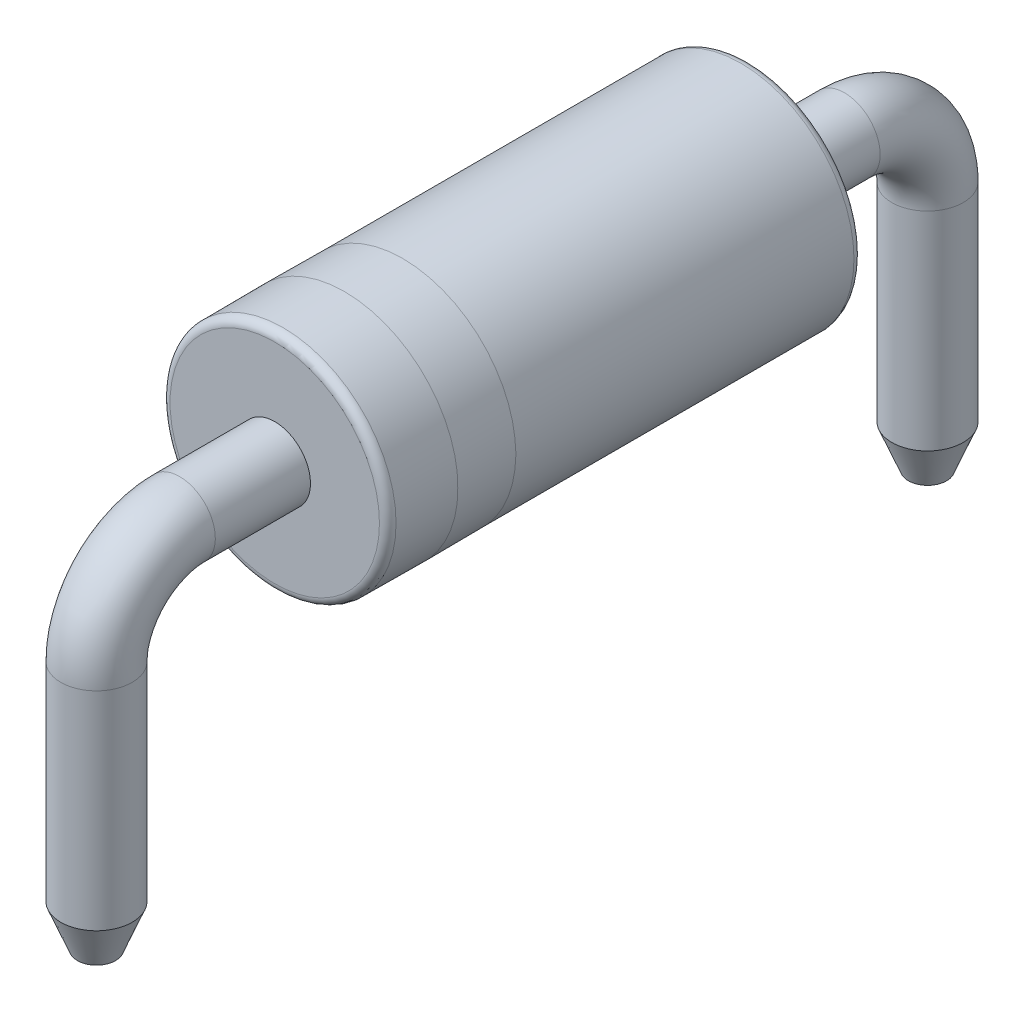
ISO-10303-21;
HEADER;
FILE_DESCRIPTION(('STEP AP214'),'2;1');
FILE_NAME('part.step','',(''),(''),'','','');
FILE_SCHEMA(('AUTOMOTIVE_DESIGN { 1 0 10303 214 1 1 1 1 }'));
ENDSEC;
DATA;
#1=APPLICATION_CONTEXT('core data for automotive mechanical design processes');
#2=APPLICATION_PROTOCOL_DEFINITION('international standard','automotive_design',2000,#1);
#3=PRODUCT_CONTEXT('',#1,'mechanical');
#4=PRODUCT('Part','Part','',(#3));
#5=PRODUCT_RELATED_PRODUCT_CATEGORY('part','',(#4));
#6=PRODUCT_DEFINITION_FORMATION('','',#4);
#7=PRODUCT_DEFINITION_CONTEXT('part definition',#1,'design');
#8=PRODUCT_DEFINITION('design','',#6,#7);
#9=PRODUCT_DEFINITION_SHAPE('','',#8);
#10=(LENGTH_UNIT() NAMED_UNIT(*) SI_UNIT(.MILLI.,.METRE.));
#11=(NAMED_UNIT(*) PLANE_ANGLE_UNIT() SI_UNIT($,.RADIAN.));
#12=(NAMED_UNIT(*) SI_UNIT($,.STERADIAN.) SOLID_ANGLE_UNIT());
#13=UNCERTAINTY_MEASURE_WITH_UNIT(LENGTH_MEASURE(1.E-05),#10,'distance_accuracy_value','');
#14=(GEOMETRIC_REPRESENTATION_CONTEXT(3) GLOBAL_UNCERTAINTY_ASSIGNED_CONTEXT((#13)) GLOBAL_UNIT_ASSIGNED_CONTEXT((#10,
#11,#12)) REPRESENTATION_CONTEXT('',''));
#15=CARTESIAN_POINT('',(0.,0.,0.));
#16=DIRECTION('',(0.,0.,1.));
#17=DIRECTION('',(1.,0.,0.));
#18=AXIS2_PLACEMENT_3D('',#15,#16,#17);
#19=CARTESIAN_POINT('',(0.,3.,3.875));
#20=DIRECTION('',(0.,0.,1.));
#21=DIRECTION('',(1.,0.,0.));
#22=AXIS2_PLACEMENT_3D('',#19,#20,#21);
#23=PLANE('',#22);
#24=CARTESIAN_POINT('',(0.,3.,3.875));
#25=DIRECTION('',(0.,0.,1.));
#26=DIRECTION('',(1.,0.,0.));
#27=AXIS2_PLACEMENT_3D('',#24,#25,#26);
#28=CIRCLE('',#27,1.26);
#29=CARTESIAN_POINT('',(1.26,3.,3.875));
#30=VERTEX_POINT('',#29);
#31=EDGE_CURVE('E56',#30,#30,#28,.T.);
#32=ORIENTED_EDGE('',*,*,#31,.T.);
#33=EDGE_LOOP('',(#32));
#34=FACE_BOUND('',#33,.T.);
#35=CARTESIAN_POINT('',(0.,2.57,3.875));
#36=CARTESIAN_POINT('',(-0.0426271971627502,2.57,3.875));
#37=CARTESIAN_POINT('',(-0.0838888384669353,2.57826232942661,3.875));
#38=CARTESIAN_POINT('',(-0.125955031522002,2.58668576421395,3.875));
#39=CARTESIAN_POINT('',(-0.164553875916989,2.60273180102014,3.875));
#40=CARTESIAN_POINT('',(-0.244041302343987,2.63577574806233,3.875));
#41=CARTESIAN_POINT('',(-0.304055915910215,2.69594408408978,3.875));
#42=CARTESIAN_POINT('',(-0.364847351205123,2.75689123161042,3.875));
#43=CARTESIAN_POINT('',(-0.397268198979853,2.83544612408301,3.875));
#44=CARTESIAN_POINT('',(-0.430108698194749,2.91501782135932,3.875));
#45=CARTESIAN_POINT('',(-0.43,3.,3.875));
#46=CARTESIAN_POINT('',(-0.429889894829274,3.08608217744095,3.875));
#47=CARTESIAN_POINT('',(-0.397268198979853,3.16455387591699,3.875));
#48=CARTESIAN_POINT('',(-0.36422425193762,3.24404130234403,3.875));
#49=CARTESIAN_POINT('',(-0.304055915910215,3.30405591591021,3.875));
#50=CARTESIAN_POINT('',(-0.243108768389557,3.36484735120514,3.875));
#51=CARTESIAN_POINT('',(-0.164553875916989,3.39726819897985,3.875));
#52=CARTESIAN_POINT('',(-0.0852455516116401,3.43,3.875));
#53=CARTESIAN_POINT('',(0.,3.43,3.875));
#54=B_SPLINE_CURVE_WITH_KNOTS('',2,(#35,#36,#37,#38,#39,#40,#41,#42,#43,#44,#45,#46,#47,#48,#49,
#50,#51,#52,#53),.UNSPECIFIED.,.F.,.F.,(3,2,2,2,2,2,2,2,2,3),(0.,0.0625,0.125,0.25,0.375,0.5,
0.625,0.75,0.875,1.),.UNSPECIFIED.);
#55=CARTESIAN_POINT('',(0.,2.57,3.875));
#56=VERTEX_POINT('',#55);
#57=CARTESIAN_POINT('',(0.,3.43,3.875));
#58=VERTEX_POINT('',#57);
#59=EDGE_CURVE('E151',#56,#58,#54,.T.);
#60=ORIENTED_EDGE('',*,*,#59,.T.);
#61=CARTESIAN_POINT('',(0.,3.43,3.875));
#62=CARTESIAN_POINT('',(0.0426271971627491,3.43,3.875));
#63=CARTESIAN_POINT('',(0.0838888384669352,3.42173767057339,3.875));
#64=CARTESIAN_POINT('',(0.125955031522003,3.41331423578605,3.875));
#65=CARTESIAN_POINT('',(0.164553875916989,3.39726819897985,3.875));
#66=CARTESIAN_POINT('',(0.244041302343981,3.36422425193767,3.875));
#67=CARTESIAN_POINT('',(0.304055915910215,3.30405591591021,3.875));
#68=CARTESIAN_POINT('',(0.364847351205144,3.24310876838956,3.875));
#69=CARTESIAN_POINT('',(0.397268198979853,3.16455387591699,3.875));
#70=CARTESIAN_POINT('',(0.430108698194749,3.08498217864064,3.875));
#71=CARTESIAN_POINT('',(0.43,3.,3.875));
#72=CARTESIAN_POINT('',(0.429889894829274,2.91391782255908,3.875));
#73=CARTESIAN_POINT('',(0.397268198979853,2.83544612408301,3.875));
#74=CARTESIAN_POINT('',(0.364224251937647,2.755958697656,3.875));
#75=CARTESIAN_POINT('',(0.304055915910215,2.69594408408978,3.875));
#76=CARTESIAN_POINT('',(0.243108768389568,2.63515264879486,3.875));
#77=CARTESIAN_POINT('',(0.164553875916989,2.60273180102014,3.875));
#78=CARTESIAN_POINT('',(0.085245551611646,2.57,3.875));
#79=CARTESIAN_POINT('',(0.,2.57,3.875));
#80=B_SPLINE_CURVE_WITH_KNOTS('',2,(#61,#62,#63,#64,#65,#66,#67,#68,#69,#70,#71,#72,#73,#74,#75,
#76,#77,#78,#79),.UNSPECIFIED.,.F.,.F.,(3,2,2,2,2,2,2,2,2,3),(0.,0.0625,0.125,0.25,0.375,0.5,
0.625,0.75,0.875,1.),.UNSPECIFIED.);
#81=EDGE_CURVE('E70',#58,#56,#80,.T.);
#82=ORIENTED_EDGE('',*,*,#81,.T.);
#83=EDGE_LOOP('',(#60,#82));
#84=FACE_BOUND('',#83,.T.);
#85=ADVANCED_FACE('F48',(#34,#84),#23,.T.);
#86=CARTESIAN_POINT('',(0.,3.,-1.835));
#87=DIRECTION('',(0.,0.,1.));
#88=DIRECTION('',(1.,0.,0.));
#89=AXIS2_PLACEMENT_3D('',#86,#87,#88);
#90=PLANE('',#89);
#91=CARTESIAN_POINT('',(0.,3.,-1.835));
#92=DIRECTION('',(0.,0.,1.));
#93=DIRECTION('',(1.,0.,0.));
#94=AXIS2_PLACEMENT_3D('',#91,#92,#93);
#95=CIRCLE('',#94,1.26);
#96=CARTESIAN_POINT('',(1.26,3.,-1.835));
#97=VERTEX_POINT('',#96);
#98=EDGE_CURVE('E359',#97,#97,#95,.F.);
#99=ORIENTED_EDGE('',*,*,#98,.T.);
#100=EDGE_LOOP('',(#99));
#101=FACE_BOUND('',#100,.T.);
#102=CARTESIAN_POINT('',(0.,3.,-1.835));
#103=DIRECTION('',(0.,0.,-1.));
#104=DIRECTION('',(0.,1.,0.));
#105=AXIS2_PLACEMENT_3D('',#102,#103,#104);
#106=CIRCLE('',#105,0.43);
#107=CARTESIAN_POINT('',(0.,3.43,-1.835));
#108=VERTEX_POINT('',#107);
#109=CARTESIAN_POINT('',(0.,2.57,-1.835));
#110=VERTEX_POINT('',#109);
#111=EDGE_CURVE('E88',#108,#110,#106,.T.);
#112=ORIENTED_EDGE('',*,*,#111,.F.);
#113=CARTESIAN_POINT('',(0.,3.,-1.835));
#114=DIRECTION('',(0.,0.,-1.));
#115=DIRECTION('',(0.,-1.,0.));
#116=AXIS2_PLACEMENT_3D('',#113,#114,#115);
#117=CIRCLE('',#116,0.43);
#118=EDGE_CURVE('E62',#110,#108,#117,.T.);
#119=ORIENTED_EDGE('',*,*,#118,.F.);
#120=EDGE_LOOP('',(#112,#119));
#121=FACE_BOUND('',#120,.T.);
#122=ADVANCED_FACE('F98',(#101,#121),#90,.F.);
#123=CARTESIAN_POINT('',(0.,3.,3.875));
#124=DIRECTION('',(0.,0.,-1.));
#125=DIRECTION('',(-1.,0.,0.));
#126=AXIS2_PLACEMENT_3D('',#123,#124,#125);
#127=CYLINDRICAL_SURFACE('',#126,1.36);
#128=CARTESIAN_POINT('',(0.,3.,3.775));
#129=DIRECTION('',(0.,0.,1.));
#130=DIRECTION('',(1.,0.,0.));
#131=AXIS2_PLACEMENT_3D('',#128,#129,#130);
#132=CIRCLE('',#131,1.36);
#133=CARTESIAN_POINT('',(1.36,3.,3.775));
#134=VERTEX_POINT('',#133);
#135=EDGE_CURVE('E13',#134,#134,#132,.F.);
#136=ORIENTED_EDGE('',*,*,#135,.T.);
#137=EDGE_LOOP('',(#136));
#138=FACE_BOUND('',#137,.T.);
#139=CARTESIAN_POINT('',(0.,3.,3.035));
#140=DIRECTION('',(0.,0.,-1.));
#141=DIRECTION('',(1.,0.,0.));
#142=AXIS2_PLACEMENT_3D('',#139,#140,#141);
#143=CIRCLE('',#142,1.365);
#144=CARTESIAN_POINT('',(1.3625,3.,3.035));
#145=VERTEX_POINT('',#144);
#146=CARTESIAN_POINT('',(-1.3625,3.,3.035));
#147=VERTEX_POINT('',#146);
#148=EDGE_CURVE('E165',#145,#147,#143,.T.);
#149=ORIENTED_EDGE('',*,*,#148,.F.);
#150=CARTESIAN_POINT('',(0.,3.,3.035));
#151=DIRECTION('',(0.,0.,-1.));
#152=DIRECTION('',(-1.,0.,0.));
#153=AXIS2_PLACEMENT_3D('',#150,#151,#152);
#154=CIRCLE('',#153,1.365);
#155=EDGE_CURVE('E344',#147,#145,#154,.T.);
#156=ORIENTED_EDGE('',*,*,#155,.F.);
#157=EDGE_LOOP('',(#149,#156));
#158=FACE_BOUND('',#157,.T.);
#159=ADVANCED_FACE('F120',(#138,#158),#127,.T.);
#160=CARTESIAN_POINT('',(0.,3.,3.035));
#161=DIRECTION('',(0.,0.,-1.));
#162=DIRECTION('',(-1.,0.,0.));
#163=AXIS2_PLACEMENT_3D('',#160,#161,#162);
#164=CYLINDRICAL_SURFACE('',#163,1.365);
#165=CARTESIAN_POINT('',(0.,3.,2.335));
#166=DIRECTION('',(0.,0.,-1.));
#167=DIRECTION('',(1.,0.,0.));
#168=AXIS2_PLACEMENT_3D('',#165,#166,#167);
#169=CIRCLE('',#168,1.36);
#170=CARTESIAN_POINT('',(1.3625,3.,2.335));
#171=VERTEX_POINT('',#170);
#172=CARTESIAN_POINT('',(-1.3625,3.,2.335));
#173=VERTEX_POINT('',#172);
#174=EDGE_CURVE('E348',#171,#173,#169,.T.);
#175=ORIENTED_EDGE('',*,*,#174,.F.);
#176=CARTESIAN_POINT('',(0.,3.,2.335));
#177=DIRECTION('',(0.,0.,-1.));
#178=DIRECTION('',(-1.,0.,0.));
#179=AXIS2_PLACEMENT_3D('',#176,#177,#178);
#180=CIRCLE('',#179,1.36);
#181=EDGE_CURVE('E351',#173,#171,#180,.T.);
#182=ORIENTED_EDGE('',*,*,#181,.F.);
#183=EDGE_LOOP('',(#175,#182));
#184=FACE_BOUND('',#183,.T.);
#185=ORIENTED_EDGE('',*,*,#155,.T.);
#186=ORIENTED_EDGE('',*,*,#148,.T.);
#187=EDGE_LOOP('',(#185,#186));
#188=FACE_BOUND('',#187,.T.);
#189=ADVANCED_FACE('F193',(#184,#188),#164,.T.);
#190=CARTESIAN_POINT('',(0.,3.,-1.835));
#191=DIRECTION('',(0.,0.,1.));
#192=DIRECTION('',(1.,0.,0.));
#193=AXIS2_PLACEMENT_3D('',#190,#191,#192);
#194=CYLINDRICAL_SURFACE('',#193,1.36);
#195=CARTESIAN_POINT('',(0.,3.,-1.735));
#196=DIRECTION('',(0.,0.,1.));
#197=DIRECTION('',(1.,0.,0.));
#198=AXIS2_PLACEMENT_3D('',#195,#196,#197);
#199=CIRCLE('',#198,1.36);
#200=CARTESIAN_POINT('',(1.36,3.,-1.735));
#201=VERTEX_POINT('',#200);
#202=EDGE_CURVE('E109',#201,#201,#199,.T.);
#203=ORIENTED_EDGE('',*,*,#202,.T.);
#204=EDGE_LOOP('',(#203));
#205=FACE_BOUND('',#204,.T.);
#206=ORIENTED_EDGE('',*,*,#174,.T.);
#207=ORIENTED_EDGE('',*,*,#181,.T.);
#208=EDGE_LOOP('',(#206,#207));
#209=FACE_BOUND('',#208,.T.);
#210=ADVANCED_FACE('F186',(#205,#209),#194,.T.);
#211=CARTESIAN_POINT('',(0.,3.,5.02));
#212=DIRECTION('',(0.,0.,-1.));
#213=DIRECTION('',(0.,1.,0.));
#214=AXIS2_PLACEMENT_3D('',#211,#212,#213);
#215=CYLINDRICAL_SURFACE('',#214,0.43);
#216=CARTESIAN_POINT('',(0.,3.,5.02));
#217=DIRECTION('',(0.,0.,-1.));
#218=DIRECTION('',(0.,1.,0.));
#219=AXIS2_PLACEMENT_3D('',#216,#217,#218);
#220=CIRCLE('',#219,0.43);
#221=CARTESIAN_POINT('',(0.,3.43,5.02));
#222=VERTEX_POINT('',#221);
#223=EDGE_CURVE('E162',#222,#222,#220,.F.);
#224=ORIENTED_EDGE('',*,*,#223,.F.);
#225=EDGE_LOOP('',(#224));
#226=FACE_BOUND('',#225,.T.);
#227=ORIENTED_EDGE('',*,*,#59,.F.);
#228=ORIENTED_EDGE('',*,*,#81,.F.);
#229=EDGE_LOOP('',(#227,#228));
#230=FACE_BOUND('',#229,.T.);
#231=ADVANCED_FACE('F128',(#226,#230),#215,.T.);
#232=CARTESIAN_POINT('',(0.,2.,5.02));
#233=DIRECTION('',(-1.,0.,0.));
#234=DIRECTION('',(0.,0.,1.));
#235=AXIS2_PLACEMENT_3D('',#232,#233,#234);
#236=TOROIDAL_SURFACE('',#235,0.999999999999999,0.43);
#237=ORIENTED_EDGE('',*,*,#223,.T.);
#238=EDGE_LOOP('',(#237));
#239=FACE_BOUND('',#238,.T.);
#240=CARTESIAN_POINT('',(0.,2.,6.02));
#241=DIRECTION('',(0.,1.,0.));
#242=DIRECTION('',(0.,0.,1.));
#243=AXIS2_PLACEMENT_3D('',#240,#241,#242);
#244=CIRCLE('',#243,0.43);
#245=CARTESIAN_POINT('',(0.,2.,6.45));
#246=VERTEX_POINT('',#245);
#247=EDGE_CURVE('E100',#246,#246,#244,.F.);
#248=ORIENTED_EDGE('',*,*,#247,.F.);
#249=EDGE_LOOP('',(#248));
#250=FACE_BOUND('',#249,.T.);
#251=ADVANCED_FACE('F185',(#239,#250),#236,.T.);
#252=CARTESIAN_POINT('',(0.,3.,5.02));
#253=DIRECTION('',(0.,0.,-1.));
#254=DIRECTION('',(0.,1.,0.));
#255=AXIS2_PLACEMENT_3D('',#252,#253,#254);
#256=CYLINDRICAL_SURFACE('',#255,0.43);
#257=CARTESIAN_POINT('',(0.,3.,-2.98));
#258=DIRECTION('',(0.,0.,-1.));
#259=DIRECTION('',(0.,1.,0.));
#260=AXIS2_PLACEMENT_3D('',#257,#258,#259);
#261=CIRCLE('',#260,0.43);
#262=CARTESIAN_POINT('',(0.,3.43,-2.98));
#263=VERTEX_POINT('',#262);
#264=EDGE_CURVE('E94',#263,#263,#261,.T.);
#265=ORIENTED_EDGE('',*,*,#264,.F.);
#266=EDGE_LOOP('',(#265));
#267=FACE_BOUND('',#266,.T.);
#268=ORIENTED_EDGE('',*,*,#111,.T.);
#269=ORIENTED_EDGE('',*,*,#118,.T.);
#270=EDGE_LOOP('',(#268,#269));
#271=FACE_BOUND('',#270,.T.);
#272=ADVANCED_FACE('F90',(#267,#271),#256,.T.);
#273=CARTESIAN_POINT('',(0.,2.,-2.98));
#274=DIRECTION('',(-1.,0.,0.));
#275=DIRECTION('',(0.,0.,1.));
#276=AXIS2_PLACEMENT_3D('',#273,#274,#275);
#277=TOROIDAL_SURFACE('',#276,0.999999999999999,0.43);
#278=ORIENTED_EDGE('',*,*,#264,.T.);
#279=EDGE_LOOP('',(#278));
#280=FACE_BOUND('',#279,.T.);
#281=CARTESIAN_POINT('',(0.,2.,-3.98));
#282=DIRECTION('',(0.,1.,0.));
#283=DIRECTION('',(0.,0.,1.));
#284=AXIS2_PLACEMENT_3D('',#281,#282,#283);
#285=CIRCLE('',#284,0.43);
#286=CARTESIAN_POINT('',(0.,2.,-3.55));
#287=VERTEX_POINT('',#286);
#288=EDGE_CURVE('E562',#287,#287,#285,.F.);
#289=ORIENTED_EDGE('',*,*,#288,.F.);
#290=EDGE_LOOP('',(#289));
#291=FACE_BOUND('',#290,.T.);
#292=ADVANCED_FACE('F411',(#280,#291),#277,.T.);
#293=CARTESIAN_POINT('',(0.,-0.500000000000001,6.02));
#294=DIRECTION('',(0.,1.,0.));
#295=DIRECTION('',(0.,0.,1.));
#296=AXIS2_PLACEMENT_3D('',#293,#294,#295);
#297=CYLINDRICAL_SURFACE('',#296,0.43);
#298=CARTESIAN_POINT('',(0.,-0.500000000000001,6.02));
#299=DIRECTION('',(0.,-1.,0.));
#300=DIRECTION('',(0.,0.,-1.));
#301=AXIS2_PLACEMENT_3D('',#298,#299,#300);
#302=CIRCLE('',#301,0.43);
#303=CARTESIAN_POINT('',(0.,-0.500000000000001,5.59));
#304=VERTEX_POINT('',#303);
#305=EDGE_CURVE('E566',#304,#304,#302,.T.);
#306=ORIENTED_EDGE('',*,*,#305,.F.);
#307=EDGE_LOOP('',(#306));
#308=FACE_BOUND('',#307,.T.);
#309=ORIENTED_EDGE('',*,*,#247,.T.);
#310=EDGE_LOOP('',(#309));
#311=FACE_BOUND('',#310,.T.);
#312=ADVANCED_FACE('F419',(#308,#311),#297,.T.);
#313=CARTESIAN_POINT('',(0.,-0.500000000000001,6.02));
#314=DIRECTION('',(0.,1.,0.));
#315=DIRECTION('',(0.,0.,-1.));
#316=AXIS2_PLACEMENT_3D('',#313,#314,#315);
#317=CONICAL_SURFACE('',#316,0.429999999945066,0.380506377053558);
#318=CARTESIAN_POINT('',(0.,-1.,6.02));
#319=DIRECTION('',(0.,-1.,0.));
#320=DIRECTION('',(0.,0.,-1.));
#321=AXIS2_PLACEMENT_3D('',#318,#319,#320);
#322=CIRCLE('',#321,0.229999999979175);
#323=CARTESIAN_POINT('',(0.,-1.,5.79000000002082));
#324=VERTEX_POINT('',#323);
#325=EDGE_CURVE('E621',#324,#324,#322,.T.);
#326=ORIENTED_EDGE('',*,*,#325,.F.);
#327=EDGE_LOOP('',(#326));
#328=FACE_BOUND('',#327,.T.);
#329=ORIENTED_EDGE('',*,*,#305,.T.);
#330=EDGE_LOOP('',(#329));
#331=FACE_BOUND('',#330,.T.);
#332=ADVANCED_FACE('F427',(#328,#331),#317,.T.);
#333=CARTESIAN_POINT('',(0.,-1.,6.02));
#334=DIRECTION('',(0.,-1.,0.));
#335=DIRECTION('',(0.,0.,-1.));
#336=AXIS2_PLACEMENT_3D('',#333,#334,#335);
#337=PLANE('',#336);
#338=ORIENTED_EDGE('',*,*,#325,.T.);
#339=EDGE_LOOP('',(#338));
#340=FACE_BOUND('',#339,.T.);
#341=ADVANCED_FACE('F435',(#340),#337,.T.);
#342=CARTESIAN_POINT('',(0.,-0.499999999999991,-3.98));
#343=DIRECTION('',(0.,1.,0.));
#344=DIRECTION('',(0.,0.,1.));
#345=AXIS2_PLACEMENT_3D('',#342,#343,#344);
#346=CYLINDRICAL_SURFACE('',#345,0.43);
#347=CARTESIAN_POINT('',(0.,-0.499999999999991,-3.98));
#348=DIRECTION('',(0.,-1.,0.));
#349=DIRECTION('',(0.,0.,-1.));
#350=AXIS2_PLACEMENT_3D('',#347,#348,#349);
#351=CIRCLE('',#350,0.43);
#352=CARTESIAN_POINT('',(0.,-0.499999999999991,-4.41));
#353=VERTEX_POINT('',#352);
#354=EDGE_CURVE('E624',#353,#353,#351,.T.);
#355=ORIENTED_EDGE('',*,*,#354,.F.);
#356=EDGE_LOOP('',(#355));
#357=FACE_BOUND('',#356,.T.);
#358=ORIENTED_EDGE('',*,*,#288,.T.);
#359=EDGE_LOOP('',(#358));
#360=FACE_BOUND('',#359,.T.);
#361=ADVANCED_FACE('F443',(#357,#360),#346,.T.);
#362=CARTESIAN_POINT('',(0.,-0.499999999999991,-3.98));
#363=DIRECTION('',(0.,1.,0.));
#364=DIRECTION('',(0.,0.,-1.));
#365=AXIS2_PLACEMENT_3D('',#362,#363,#364);
#366=CONICAL_SURFACE('',#365,0.429999999999639,0.380506377141763);
#367=CARTESIAN_POINT('',(0.,-1.,-3.98));
#368=DIRECTION('',(0.,-1.,0.));
#369=DIRECTION('',(0.,0.,-1.));
#370=AXIS2_PLACEMENT_3D('',#367,#368,#369);
#371=CIRCLE('',#370,0.229999999982584);
#372=CARTESIAN_POINT('',(0.,-1.,-4.20999999998258));
#373=VERTEX_POINT('',#372);
#374=EDGE_CURVE('E627',#373,#373,#371,.T.);
#375=ORIENTED_EDGE('',*,*,#374,.F.);
#376=EDGE_LOOP('',(#375));
#377=FACE_BOUND('',#376,.T.);
#378=ORIENTED_EDGE('',*,*,#354,.T.);
#379=EDGE_LOOP('',(#378));
#380=FACE_BOUND('',#379,.T.);
#381=ADVANCED_FACE('F450',(#377,#380),#366,.T.);
#382=CARTESIAN_POINT('',(0.,-1.,-3.98));
#383=DIRECTION('',(0.,-1.,0.));
#384=DIRECTION('',(0.,0.,-1.));
#385=AXIS2_PLACEMENT_3D('',#382,#383,#384);
#386=PLANE('',#385);
#387=ORIENTED_EDGE('',*,*,#374,.T.);
#388=EDGE_LOOP('',(#387));
#389=FACE_BOUND('',#388,.T.);
#390=ADVANCED_FACE('F371',(#389),#386,.T.);
#391=CARTESIAN_POINT('',(0.,3.,-1.735));
#392=DIRECTION('',(0.,0.,1.));
#393=DIRECTION('',(1.,0.,0.));
#394=AXIS2_PLACEMENT_3D('',#391,#392,#393);
#395=TOROIDAL_SURFACE('',#394,1.26,0.1);
#396=ORIENTED_EDGE('',*,*,#98,.F.);
#397=EDGE_LOOP('',(#396));
#398=FACE_BOUND('',#397,.T.);
#399=ORIENTED_EDGE('',*,*,#202,.F.);
#400=EDGE_LOOP('',(#399));
#401=FACE_BOUND('',#400,.T.);
#402=ADVANCED_FACE('F129',(#398,#401),#395,.T.);
#403=CARTESIAN_POINT('',(0.,3.,3.775));
#404=DIRECTION('',(0.,0.,1.));
#405=DIRECTION('',(1.,0.,0.));
#406=AXIS2_PLACEMENT_3D('',#403,#404,#405);
#407=TOROIDAL_SURFACE('',#406,1.26,0.1);
#408=ORIENTED_EDGE('',*,*,#135,.F.);
#409=EDGE_LOOP('',(#408));
#410=FACE_BOUND('',#409,.T.);
#411=ORIENTED_EDGE('',*,*,#31,.F.);
#412=EDGE_LOOP('',(#411));
#413=FACE_BOUND('',#412,.T.);
#414=ADVANCED_FACE('F50',(#410,#413),#407,.T.);
#415=CLOSED_SHELL('',(#85,#122,#159,#189,#210,#231,#251,#272,#292,#312,#332,#341,#361,#381,#390,
#402,#414));
#416=MANIFOLD_SOLID_BREP('B2',#415);
#417=ADVANCED_BREP_SHAPE_REPRESENTATION('',(#18,#416),#14);
#418=SHAPE_DEFINITION_REPRESENTATION(#9,#417);
ENDSEC;
END-ISO-10303-21;
